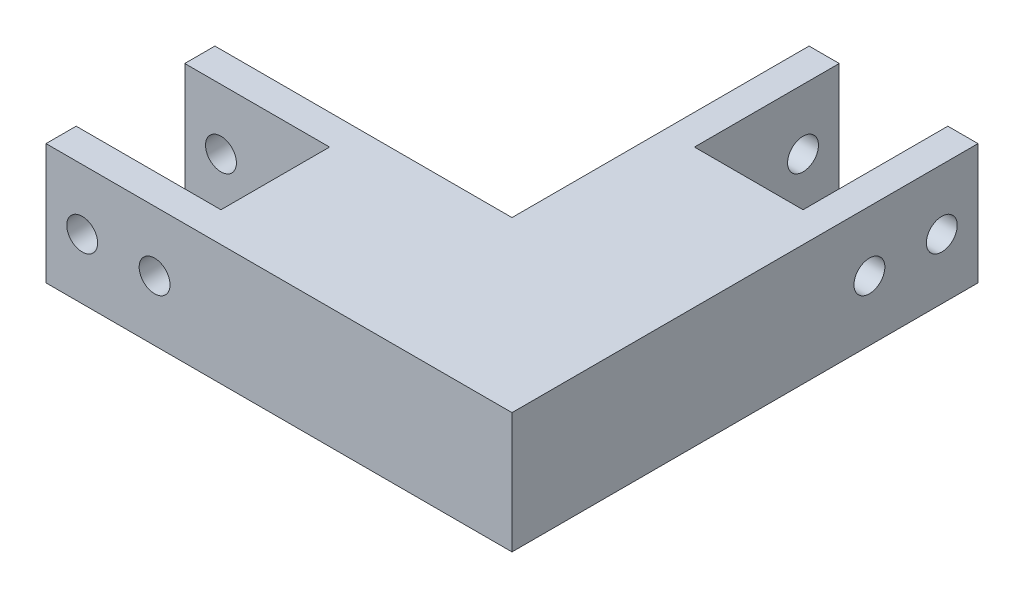
ISO-10303-21;
HEADER;
FILE_DESCRIPTION(('STEP AP214'),'2;1');
FILE_NAME('part.step','',(''),(''),'','','');
FILE_SCHEMA(('AUTOMOTIVE_DESIGN { 1 0 10303 214 1 1 1 1 }'));
ENDSEC;
DATA;
#1=APPLICATION_CONTEXT('core data for automotive mechanical design processes');
#2=APPLICATION_PROTOCOL_DEFINITION('international standard','automotive_design',2000,#1);
#3=PRODUCT_CONTEXT('',#1,'mechanical');
#4=PRODUCT('Part','Part','',(#3));
#5=PRODUCT_RELATED_PRODUCT_CATEGORY('part','',(#4));
#6=PRODUCT_DEFINITION_FORMATION('','',#4);
#7=PRODUCT_DEFINITION_CONTEXT('part definition',#1,'design');
#8=PRODUCT_DEFINITION('design','',#6,#7);
#9=PRODUCT_DEFINITION_SHAPE('','',#8);
#10=(LENGTH_UNIT() NAMED_UNIT(*) SI_UNIT(.MILLI.,.METRE.));
#11=(NAMED_UNIT(*) PLANE_ANGLE_UNIT() SI_UNIT($,.RADIAN.));
#12=(NAMED_UNIT(*) SI_UNIT($,.STERADIAN.) SOLID_ANGLE_UNIT());
#13=UNCERTAINTY_MEASURE_WITH_UNIT(LENGTH_MEASURE(1.E-05),#10,'distance_accuracy_value','');
#14=(GEOMETRIC_REPRESENTATION_CONTEXT(3) GLOBAL_UNCERTAINTY_ASSIGNED_CONTEXT((#13)) GLOBAL_UNIT_ASSIGNED_CONTEXT((#10,
#11,#12)) REPRESENTATION_CONTEXT('',''));
#15=CARTESIAN_POINT('',(0.,0.,0.));
#16=DIRECTION('',(0.,0.,1.));
#17=DIRECTION('',(1.,0.,0.));
#18=AXIS2_PLACEMENT_3D('',#15,#16,#17);
#19=CARTESIAN_POINT('',(-17.5,25.,-17.5));
#20=DIRECTION('',(1.,0.,0.));
#21=DIRECTION('',(0.,0.,-1.));
#22=AXIS2_PLACEMENT_3D('',#19,#20,#21);
#23=PLANE('',#22);
#24=CARTESIAN_POINT('',(-17.5,12.5,-56.55));
#25=DIRECTION('',(1.,0.,0.));
#26=DIRECTION('',(0.,0.,-1.));
#27=AXIS2_PLACEMENT_3D('',#24,#25,#26);
#28=CIRCLE('',#27,3.2);
#29=CARTESIAN_POINT('',(-17.5,12.5,-59.75));
#30=VERTEX_POINT('',#29);
#31=EDGE_CURVE('E296',#30,#30,#28,.F.);
#32=ORIENTED_EDGE('',*,*,#31,.F.);
#33=EDGE_LOOP('',(#32));
#34=FACE_BOUND('',#33,.T.);
#35=CARTESIAN_POINT('',(-17.5,12.5,-71.55));
#36=DIRECTION('',(1.,0.,0.));
#37=DIRECTION('',(0.,0.,-1.));
#38=AXIS2_PLACEMENT_3D('',#35,#36,#37);
#39=CIRCLE('',#38,3.2);
#40=CARTESIAN_POINT('',(-17.5,12.5,-74.75));
#41=VERTEX_POINT('',#40);
#42=EDGE_CURVE('E225',#41,#41,#39,.F.);
#43=ORIENTED_EDGE('',*,*,#42,.F.);
#44=EDGE_LOOP('',(#43));
#45=FACE_BOUND('',#44,.T.);
#46=DIRECTION('',(0.,0.,1.));
#47=VECTOR('',#46,1.);
#48=CARTESIAN_POINT('',(-17.5,0.,-17.5));
#49=LINE('',#48,#47);
#50=CARTESIAN_POINT('',(-17.5,0.,-79.05));
#51=VERTEX_POINT('',#50);
#52=CARTESIAN_POINT('',(-17.5,0.,-17.5));
#53=VERTEX_POINT('',#52);
#54=EDGE_CURVE('E167',#51,#53,#49,.T.);
#55=ORIENTED_EDGE('',*,*,#54,.T.);
#56=DIRECTION('',(0.,-1.,0.));
#57=VECTOR('',#56,1.);
#58=CARTESIAN_POINT('',(-17.5,25.,-17.5));
#59=LINE('',#58,#57);
#60=CARTESIAN_POINT('',(-17.5,25.,-17.5));
#61=VERTEX_POINT('',#60);
#62=EDGE_CURVE('E11',#61,#53,#59,.T.);
#63=ORIENTED_EDGE('',*,*,#62,.F.);
#64=DIRECTION('',(0.,0.,1.));
#65=VECTOR('',#64,1.);
#66=CARTESIAN_POINT('',(-17.5,25.,-17.5));
#67=LINE('',#66,#65);
#68=CARTESIAN_POINT('',(-17.5,25.,-79.05));
#69=VERTEX_POINT('',#68);
#70=EDGE_CURVE('E194',#69,#61,#67,.T.);
#71=ORIENTED_EDGE('',*,*,#70,.F.);
#72=DIRECTION('',(0.,-1.,0.));
#73=VECTOR('',#72,1.);
#74=CARTESIAN_POINT('',(-17.5,25.,-79.05));
#75=LINE('',#74,#73);
#76=EDGE_CURVE('E163',#69,#51,#75,.T.);
#77=ORIENTED_EDGE('',*,*,#76,.T.);
#78=EDGE_LOOP('',(#55,#63,#71,#77));
#79=FACE_BOUND('',#78,.T.);
#80=ADVANCED_FACE('F33',(#34,#45,#79),#23,.F.);
#81=CARTESIAN_POINT('',(-79.05,25.,-17.5));
#82=DIRECTION('',(0.,0.,1.));
#83=DIRECTION('',(1.,0.,0.));
#84=AXIS2_PLACEMENT_3D('',#81,#82,#83);
#85=PLANE('',#84);
#86=CARTESIAN_POINT('',(-56.55,12.5,-17.5));
#87=DIRECTION('',(0.,0.,1.));
#88=DIRECTION('',(1.,0.,0.));
#89=AXIS2_PLACEMENT_3D('',#86,#87,#88);
#90=CIRCLE('',#89,3.2);
#91=CARTESIAN_POINT('',(-53.35,12.5,-17.5));
#92=VERTEX_POINT('',#91);
#93=EDGE_CURVE('E436',#92,#92,#90,.F.);
#94=ORIENTED_EDGE('',*,*,#93,.F.);
#95=EDGE_LOOP('',(#94));
#96=FACE_BOUND('',#95,.T.);
#97=CARTESIAN_POINT('',(-71.55,12.5,-17.5));
#98=DIRECTION('',(0.,0.,1.));
#99=DIRECTION('',(1.,0.,0.));
#100=AXIS2_PLACEMENT_3D('',#97,#98,#99);
#101=CIRCLE('',#100,3.2);
#102=CARTESIAN_POINT('',(-68.35,12.5,-17.5));
#103=VERTEX_POINT('',#102);
#104=EDGE_CURVE('E444',#103,#103,#101,.F.);
#105=ORIENTED_EDGE('',*,*,#104,.F.);
#106=EDGE_LOOP('',(#105));
#107=FACE_BOUND('',#106,.T.);
#108=DIRECTION('',(-1.,0.,0.));
#109=VECTOR('',#108,1.);
#110=CARTESIAN_POINT('',(-79.05,0.,-17.5));
#111=LINE('',#110,#109);
#112=CARTESIAN_POINT('',(-79.05,0.,-17.5));
#113=VERTEX_POINT('',#112);
#114=EDGE_CURVE('E170',#53,#113,#111,.T.);
#115=ORIENTED_EDGE('',*,*,#114,.T.);
#116=DIRECTION('',(0.,-1.,0.));
#117=VECTOR('',#116,1.);
#118=CARTESIAN_POINT('',(-79.05,25.,-17.5));
#119=LINE('',#118,#117);
#120=CARTESIAN_POINT('',(-79.05,25.,-17.5));
#121=VERTEX_POINT('',#120);
#122=EDGE_CURVE('E42',#121,#113,#119,.T.);
#123=ORIENTED_EDGE('',*,*,#122,.F.);
#124=DIRECTION('',(-1.,0.,0.));
#125=VECTOR('',#124,1.);
#126=CARTESIAN_POINT('',(-79.05,25.,-17.5));
#127=LINE('',#126,#125);
#128=EDGE_CURVE('E112',#61,#121,#127,.T.);
#129=ORIENTED_EDGE('',*,*,#128,.F.);
#130=ORIENTED_EDGE('',*,*,#62,.T.);
#131=EDGE_LOOP('',(#115,#123,#129,#130));
#132=FACE_BOUND('',#131,.T.);
#133=ADVANCED_FACE('F286',(#96,#107,#132),#85,.F.);
#134=CARTESIAN_POINT('',(-79.05,25.,-11.25));
#135=DIRECTION('',(1.,0.,0.));
#136=DIRECTION('',(0.,0.,-1.));
#137=AXIS2_PLACEMENT_3D('',#134,#135,#136);
#138=PLANE('',#137);
#139=DIRECTION('',(0.,0.,1.));
#140=VECTOR('',#139,1.);
#141=CARTESIAN_POINT('',(-79.05,0.,-11.25));
#142=LINE('',#141,#140);
#143=CARTESIAN_POINT('',(-79.05,0.,-11.25));
#144=VERTEX_POINT('',#143);
#145=EDGE_CURVE('E173',#113,#144,#142,.T.);
#146=ORIENTED_EDGE('',*,*,#145,.T.);
#147=DIRECTION('',(0.,-1.,0.));
#148=VECTOR('',#147,1.);
#149=CARTESIAN_POINT('',(-79.05,25.,-11.25));
#150=LINE('',#149,#148);
#151=CARTESIAN_POINT('',(-79.05,25.,-11.25));
#152=VERTEX_POINT('',#151);
#153=EDGE_CURVE('E219',#152,#144,#150,.T.);
#154=ORIENTED_EDGE('',*,*,#153,.F.);
#155=DIRECTION('',(0.,0.,1.));
#156=VECTOR('',#155,1.);
#157=CARTESIAN_POINT('',(-79.05,25.,-11.25));
#158=LINE('',#157,#156);
#159=EDGE_CURVE('E242',#121,#152,#158,.T.);
#160=ORIENTED_EDGE('',*,*,#159,.F.);
#161=ORIENTED_EDGE('',*,*,#122,.T.);
#162=EDGE_LOOP('',(#146,#154,#160,#161));
#163=FACE_BOUND('',#162,.T.);
#164=ADVANCED_FACE('F291',(#163),#138,.F.);
#165=CARTESIAN_POINT('',(-49.05,25.,-11.25));
#166=DIRECTION('',(0.,0.,-1.));
#167=DIRECTION('',(-1.,0.,0.));
#168=AXIS2_PLACEMENT_3D('',#165,#166,#167);
#169=PLANE('',#168);
#170=CARTESIAN_POINT('',(-56.55,12.5,-11.25));
#171=DIRECTION('',(0.,0.,-1.));
#172=DIRECTION('',(-1.,0.,0.));
#173=AXIS2_PLACEMENT_3D('',#170,#171,#172);
#174=CIRCLE('',#173,3.2);
#175=CARTESIAN_POINT('',(-59.75,12.5,-11.25));
#176=VERTEX_POINT('',#175);
#177=EDGE_CURVE('E439',#176,#176,#174,.T.);
#178=ORIENTED_EDGE('',*,*,#177,.T.);
#179=EDGE_LOOP('',(#178));
#180=FACE_BOUND('',#179,.T.);
#181=CARTESIAN_POINT('',(-71.55,12.5,-11.25));
#182=DIRECTION('',(0.,0.,-1.));
#183=DIRECTION('',(-1.,0.,0.));
#184=AXIS2_PLACEMENT_3D('',#181,#182,#183);
#185=CIRCLE('',#184,3.2);
#186=CARTESIAN_POINT('',(-74.75,12.5,-11.25));
#187=VERTEX_POINT('',#186);
#188=EDGE_CURVE('E302',#187,#187,#185,.T.);
#189=ORIENTED_EDGE('',*,*,#188,.T.);
#190=EDGE_LOOP('',(#189));
#191=FACE_BOUND('',#190,.T.);
#192=DIRECTION('',(1.,0.,0.));
#193=VECTOR('',#192,1.);
#194=CARTESIAN_POINT('',(-49.05,0.,-11.25));
#195=LINE('',#194,#193);
#196=CARTESIAN_POINT('',(-49.05,0.,-11.25));
#197=VERTEX_POINT('',#196);
#198=EDGE_CURVE('E175',#144,#197,#195,.T.);
#199=ORIENTED_EDGE('',*,*,#198,.T.);
#200=DIRECTION('',(0.,-1.,0.));
#201=VECTOR('',#200,1.);
#202=CARTESIAN_POINT('',(-49.05,25.,-11.25));
#203=LINE('',#202,#201);
#204=CARTESIAN_POINT('',(-49.05,25.,-11.25));
#205=VERTEX_POINT('',#204);
#206=EDGE_CURVE('E216',#205,#197,#203,.T.);
#207=ORIENTED_EDGE('',*,*,#206,.F.);
#208=DIRECTION('',(1.,0.,0.));
#209=VECTOR('',#208,1.);
#210=CARTESIAN_POINT('',(-49.05,25.,-11.25));
#211=LINE('',#210,#209);
#212=EDGE_CURVE('E244',#152,#205,#211,.T.);
#213=ORIENTED_EDGE('',*,*,#212,.F.);
#214=ORIENTED_EDGE('',*,*,#153,.T.);
#215=EDGE_LOOP('',(#199,#207,#213,#214));
#216=FACE_BOUND('',#215,.T.);
#217=ADVANCED_FACE('F364',(#180,#191,#216),#169,.F.);
#218=CARTESIAN_POINT('',(-49.05,25.,11.25));
#219=DIRECTION('',(1.,0.,0.));
#220=DIRECTION('',(0.,0.,-1.));
#221=AXIS2_PLACEMENT_3D('',#218,#219,#220);
#222=PLANE('',#221);
#223=DIRECTION('',(0.,0.,1.));
#224=VECTOR('',#223,1.);
#225=CARTESIAN_POINT('',(-49.05,0.,11.25));
#226=LINE('',#225,#224);
#227=CARTESIAN_POINT('',(-49.05,0.,11.25));
#228=VERTEX_POINT('',#227);
#229=EDGE_CURVE('E177',#197,#228,#226,.T.);
#230=ORIENTED_EDGE('',*,*,#229,.T.);
#231=DIRECTION('',(0.,-1.,0.));
#232=VECTOR('',#231,1.);
#233=CARTESIAN_POINT('',(-49.05,25.,11.25));
#234=LINE('',#233,#232);
#235=CARTESIAN_POINT('',(-49.05,25.,11.25));
#236=VERTEX_POINT('',#235);
#237=EDGE_CURVE('E213',#236,#228,#234,.T.);
#238=ORIENTED_EDGE('',*,*,#237,.F.);
#239=DIRECTION('',(0.,0.,1.));
#240=VECTOR('',#239,1.);
#241=CARTESIAN_POINT('',(-49.05,25.,11.25));
#242=LINE('',#241,#240);
#243=EDGE_CURVE('E246',#205,#236,#242,.T.);
#244=ORIENTED_EDGE('',*,*,#243,.F.);
#245=ORIENTED_EDGE('',*,*,#206,.T.);
#246=EDGE_LOOP('',(#230,#238,#244,#245));
#247=FACE_BOUND('',#246,.T.);
#248=ADVANCED_FACE('F369',(#247),#222,.F.);
#249=CARTESIAN_POINT('',(-79.05,25.,11.25));
#250=DIRECTION('',(0.,0.,1.));
#251=DIRECTION('',(1.,0.,0.));
#252=AXIS2_PLACEMENT_3D('',#249,#250,#251);
#253=PLANE('',#252);
#254=CARTESIAN_POINT('',(-56.55,12.5,11.25));
#255=DIRECTION('',(0.,0.,1.));
#256=DIRECTION('',(1.,0.,0.));
#257=AXIS2_PLACEMENT_3D('',#254,#255,#256);
#258=CIRCLE('',#257,3.2);
#259=CARTESIAN_POINT('',(-53.35,12.5,11.25));
#260=VERTEX_POINT('',#259);
#261=EDGE_CURVE('E441',#260,#260,#258,.T.);
#262=ORIENTED_EDGE('',*,*,#261,.T.);
#263=EDGE_LOOP('',(#262));
#264=FACE_BOUND('',#263,.T.);
#265=CARTESIAN_POINT('',(-71.55,12.5,11.25));
#266=DIRECTION('',(0.,0.,1.));
#267=DIRECTION('',(1.,0.,0.));
#268=AXIS2_PLACEMENT_3D('',#265,#266,#267);
#269=CIRCLE('',#268,3.2);
#270=CARTESIAN_POINT('',(-68.35,12.5,11.25));
#271=VERTEX_POINT('',#270);
#272=EDGE_CURVE('E452',#271,#271,#269,.T.);
#273=ORIENTED_EDGE('',*,*,#272,.T.);
#274=EDGE_LOOP('',(#273));
#275=FACE_BOUND('',#274,.T.);
#276=DIRECTION('',(-1.,0.,0.));
#277=VECTOR('',#276,1.);
#278=CARTESIAN_POINT('',(-79.05,0.,11.25));
#279=LINE('',#278,#277);
#280=CARTESIAN_POINT('',(-79.05,0.,11.25));
#281=VERTEX_POINT('',#280);
#282=EDGE_CURVE('E179',#228,#281,#279,.T.);
#283=ORIENTED_EDGE('',*,*,#282,.T.);
#284=DIRECTION('',(0.,-1.,0.));
#285=VECTOR('',#284,1.);
#286=CARTESIAN_POINT('',(-79.05,25.,11.25));
#287=LINE('',#286,#285);
#288=CARTESIAN_POINT('',(-79.05,25.,11.25));
#289=VERTEX_POINT('',#288);
#290=EDGE_CURVE('E210',#289,#281,#287,.T.);
#291=ORIENTED_EDGE('',*,*,#290,.F.);
#292=DIRECTION('',(-1.,0.,0.));
#293=VECTOR('',#292,1.);
#294=CARTESIAN_POINT('',(-79.05,25.,11.25));
#295=LINE('',#294,#293);
#296=EDGE_CURVE('E248',#236,#289,#295,.T.);
#297=ORIENTED_EDGE('',*,*,#296,.F.);
#298=ORIENTED_EDGE('',*,*,#237,.T.);
#299=EDGE_LOOP('',(#283,#291,#297,#298));
#300=FACE_BOUND('',#299,.T.);
#301=ADVANCED_FACE('F377',(#264,#275,#300),#253,.F.);
#302=CARTESIAN_POINT('',(-79.05,25.,17.5));
#303=DIRECTION('',(1.,0.,0.));
#304=DIRECTION('',(0.,0.,-1.));
#305=AXIS2_PLACEMENT_3D('',#302,#303,#304);
#306=PLANE('',#305);
#307=DIRECTION('',(0.,0.,1.));
#308=VECTOR('',#307,1.);
#309=CARTESIAN_POINT('',(-79.05,0.,17.5));
#310=LINE('',#309,#308);
#311=CARTESIAN_POINT('',(-79.05,0.,17.5));
#312=VERTEX_POINT('',#311);
#313=EDGE_CURVE('E181',#281,#312,#310,.T.);
#314=ORIENTED_EDGE('',*,*,#313,.T.);
#315=DIRECTION('',(0.,-1.,0.));
#316=VECTOR('',#315,1.);
#317=CARTESIAN_POINT('',(-79.05,25.,17.5));
#318=LINE('',#317,#316);
#319=CARTESIAN_POINT('',(-79.05,25.,17.5));
#320=VERTEX_POINT('',#319);
#321=EDGE_CURVE('E207',#320,#312,#318,.T.);
#322=ORIENTED_EDGE('',*,*,#321,.F.);
#323=DIRECTION('',(0.,0.,1.));
#324=VECTOR('',#323,1.);
#325=CARTESIAN_POINT('',(-79.05,25.,17.5));
#326=LINE('',#325,#324);
#327=EDGE_CURVE('E250',#289,#320,#326,.T.);
#328=ORIENTED_EDGE('',*,*,#327,.F.);
#329=ORIENTED_EDGE('',*,*,#290,.T.);
#330=EDGE_LOOP('',(#314,#322,#328,#329));
#331=FACE_BOUND('',#330,.T.);
#332=ADVANCED_FACE('F382',(#331),#306,.F.);
#333=CARTESIAN_POINT('',(17.5,25.,17.5));
#334=DIRECTION('',(0.,0.,-1.));
#335=DIRECTION('',(-1.,0.,0.));
#336=AXIS2_PLACEMENT_3D('',#333,#334,#335);
#337=PLANE('',#336);
#338=CARTESIAN_POINT('',(-56.55,12.5,17.5));
#339=DIRECTION('',(0.,0.,1.));
#340=DIRECTION('',(1.,0.,0.));
#341=AXIS2_PLACEMENT_3D('',#338,#339,#340);
#342=CIRCLE('',#341,3.2);
#343=CARTESIAN_POINT('',(-53.35,12.5,17.5));
#344=VERTEX_POINT('',#343);
#345=EDGE_CURVE('E569',#344,#344,#342,.T.);
#346=ORIENTED_EDGE('',*,*,#345,.F.);
#347=EDGE_LOOP('',(#346));
#348=FACE_BOUND('',#347,.T.);
#349=CARTESIAN_POINT('',(-71.55,12.5,17.5));
#350=DIRECTION('',(0.,0.,1.));
#351=DIRECTION('',(1.,0.,0.));
#352=AXIS2_PLACEMENT_3D('',#349,#350,#351);
#353=CIRCLE('',#352,3.2);
#354=CARTESIAN_POINT('',(-68.35,12.5,17.5));
#355=VERTEX_POINT('',#354);
#356=EDGE_CURVE('E440',#355,#355,#353,.T.);
#357=ORIENTED_EDGE('',*,*,#356,.F.);
#358=EDGE_LOOP('',(#357));
#359=FACE_BOUND('',#358,.T.);
#360=DIRECTION('',(1.,0.,0.));
#361=VECTOR('',#360,1.);
#362=CARTESIAN_POINT('',(17.5,0.,17.5));
#363=LINE('',#362,#361);
#364=CARTESIAN_POINT('',(17.5,0.,17.5));
#365=VERTEX_POINT('',#364);
#366=EDGE_CURVE('E183',#312,#365,#363,.T.);
#367=ORIENTED_EDGE('',*,*,#366,.T.);
#368=DIRECTION('',(0.,-1.,0.));
#369=VECTOR('',#368,1.);
#370=CARTESIAN_POINT('',(17.5,25.,17.5));
#371=LINE('',#370,#369);
#372=CARTESIAN_POINT('',(17.5,25.,17.5));
#373=VERTEX_POINT('',#372);
#374=EDGE_CURVE('E204',#373,#365,#371,.T.);
#375=ORIENTED_EDGE('',*,*,#374,.F.);
#376=DIRECTION('',(1.,0.,0.));
#377=VECTOR('',#376,1.);
#378=CARTESIAN_POINT('',(17.5,25.,17.5));
#379=LINE('',#378,#377);
#380=EDGE_CURVE('E252',#320,#373,#379,.T.);
#381=ORIENTED_EDGE('',*,*,#380,.F.);
#382=ORIENTED_EDGE('',*,*,#321,.T.);
#383=EDGE_LOOP('',(#367,#375,#381,#382));
#384=FACE_BOUND('',#383,.T.);
#385=ADVANCED_FACE('F390',(#348,#359,#384),#337,.F.);
#386=CARTESIAN_POINT('',(17.5,25.,-79.05));
#387=DIRECTION('',(-1.,0.,0.));
#388=DIRECTION('',(0.,0.,1.));
#389=AXIS2_PLACEMENT_3D('',#386,#387,#388);
#390=PLANE('',#389);
#391=CARTESIAN_POINT('',(17.5,12.5,-56.55));
#392=DIRECTION('',(1.,0.,0.));
#393=DIRECTION('',(0.,0.,-1.));
#394=AXIS2_PLACEMENT_3D('',#391,#392,#393);
#395=CIRCLE('',#394,3.2);
#396=CARTESIAN_POINT('',(17.5,12.5,-59.75));
#397=VERTEX_POINT('',#396);
#398=EDGE_CURVE('E298',#397,#397,#395,.T.);
#399=ORIENTED_EDGE('',*,*,#398,.F.);
#400=EDGE_LOOP('',(#399));
#401=FACE_BOUND('',#400,.T.);
#402=CARTESIAN_POINT('',(17.5,12.5,-71.55));
#403=DIRECTION('',(1.,0.,0.));
#404=DIRECTION('',(0.,0.,-1.));
#405=AXIS2_PLACEMENT_3D('',#402,#403,#404);
#406=CIRCLE('',#405,3.2);
#407=CARTESIAN_POINT('',(17.5,12.5,-74.75));
#408=VERTEX_POINT('',#407);
#409=EDGE_CURVE('E231',#408,#408,#406,.T.);
#410=ORIENTED_EDGE('',*,*,#409,.F.);
#411=EDGE_LOOP('',(#410));
#412=FACE_BOUND('',#411,.T.);
#413=DIRECTION('',(0.,0.,-1.));
#414=VECTOR('',#413,1.);
#415=CARTESIAN_POINT('',(17.5,0.,-79.05));
#416=LINE('',#415,#414);
#417=CARTESIAN_POINT('',(17.5,0.,-79.05));
#418=VERTEX_POINT('',#417);
#419=EDGE_CURVE('E185',#365,#418,#416,.T.);
#420=ORIENTED_EDGE('',*,*,#419,.T.);
#421=DIRECTION('',(0.,-1.,0.));
#422=VECTOR('',#421,1.);
#423=CARTESIAN_POINT('',(17.5,25.,-79.05));
#424=LINE('',#423,#422);
#425=CARTESIAN_POINT('',(17.5,25.,-79.05));
#426=VERTEX_POINT('',#425);
#427=EDGE_CURVE('E201',#426,#418,#424,.T.);
#428=ORIENTED_EDGE('',*,*,#427,.F.);
#429=DIRECTION('',(0.,0.,-1.));
#430=VECTOR('',#429,1.);
#431=CARTESIAN_POINT('',(17.5,25.,-79.05));
#432=LINE('',#431,#430);
#433=EDGE_CURVE('E254',#373,#426,#432,.T.);
#434=ORIENTED_EDGE('',*,*,#433,.F.);
#435=ORIENTED_EDGE('',*,*,#374,.T.);
#436=EDGE_LOOP('',(#420,#428,#434,#435));
#437=FACE_BOUND('',#436,.T.);
#438=ADVANCED_FACE('F395',(#401,#412,#437),#390,.F.);
#439=CARTESIAN_POINT('',(11.25,25.,-79.05));
#440=DIRECTION('',(0.,0.,1.));
#441=DIRECTION('',(1.,0.,0.));
#442=AXIS2_PLACEMENT_3D('',#439,#440,#441);
#443=PLANE('',#442);
#444=DIRECTION('',(-1.,0.,0.));
#445=VECTOR('',#444,1.);
#446=CARTESIAN_POINT('',(11.25,0.,-79.05));
#447=LINE('',#446,#445);
#448=CARTESIAN_POINT('',(11.25,0.,-79.05));
#449=VERTEX_POINT('',#448);
#450=EDGE_CURVE('E187',#418,#449,#447,.T.);
#451=ORIENTED_EDGE('',*,*,#450,.T.);
#452=DIRECTION('',(0.,-1.,0.));
#453=VECTOR('',#452,1.);
#454=CARTESIAN_POINT('',(11.25,25.,-79.05));
#455=LINE('',#454,#453);
#456=CARTESIAN_POINT('',(11.25,25.,-79.05));
#457=VERTEX_POINT('',#456);
#458=EDGE_CURVE('E198',#457,#449,#455,.T.);
#459=ORIENTED_EDGE('',*,*,#458,.F.);
#460=DIRECTION('',(-1.,0.,0.));
#461=VECTOR('',#460,1.);
#462=CARTESIAN_POINT('',(11.25,25.,-79.05));
#463=LINE('',#462,#461);
#464=EDGE_CURVE('E256',#426,#457,#463,.T.);
#465=ORIENTED_EDGE('',*,*,#464,.F.);
#466=ORIENTED_EDGE('',*,*,#427,.T.);
#467=EDGE_LOOP('',(#451,#459,#465,#466));
#468=FACE_BOUND('',#467,.T.);
#469=ADVANCED_FACE('F262',(#468),#443,.F.);
#470=CARTESIAN_POINT('',(11.25,25.,-49.05));
#471=DIRECTION('',(1.,0.,0.));
#472=DIRECTION('',(0.,0.,-1.));
#473=AXIS2_PLACEMENT_3D('',#470,#471,#472);
#474=PLANE('',#473);
#475=CARTESIAN_POINT('',(11.25,12.5,-56.55));
#476=DIRECTION('',(1.,0.,0.));
#477=DIRECTION('',(0.,0.,-1.));
#478=AXIS2_PLACEMENT_3D('',#475,#476,#477);
#479=CIRCLE('',#478,3.2);
#480=CARTESIAN_POINT('',(11.25,12.5,-59.75));
#481=VERTEX_POINT('',#480);
#482=EDGE_CURVE('E236',#481,#481,#479,.T.);
#483=ORIENTED_EDGE('',*,*,#482,.T.);
#484=EDGE_LOOP('',(#483));
#485=FACE_BOUND('',#484,.T.);
#486=CARTESIAN_POINT('',(11.25,12.5,-71.55));
#487=DIRECTION('',(1.,0.,0.));
#488=DIRECTION('',(0.,0.,-1.));
#489=AXIS2_PLACEMENT_3D('',#486,#487,#488);
#490=CIRCLE('',#489,3.2);
#491=CARTESIAN_POINT('',(11.25,12.5,-74.75));
#492=VERTEX_POINT('',#491);
#493=EDGE_CURVE('E171',#492,#492,#490,.T.);
#494=ORIENTED_EDGE('',*,*,#493,.T.);
#495=EDGE_LOOP('',(#494));
#496=FACE_BOUND('',#495,.T.);
#497=DIRECTION('',(0.,0.,1.));
#498=VECTOR('',#497,1.);
#499=CARTESIAN_POINT('',(11.25,0.,-49.05));
#500=LINE('',#499,#498);
#501=CARTESIAN_POINT('',(11.25,0.,-49.05));
#502=VERTEX_POINT('',#501);
#503=EDGE_CURVE('E189',#449,#502,#500,.T.);
#504=ORIENTED_EDGE('',*,*,#503,.T.);
#505=DIRECTION('',(0.,-1.,0.));
#506=VECTOR('',#505,1.);
#507=CARTESIAN_POINT('',(11.25,25.,-49.05));
#508=LINE('',#507,#506);
#509=CARTESIAN_POINT('',(11.25,25.,-49.05));
#510=VERTEX_POINT('',#509);
#511=EDGE_CURVE('E158',#510,#502,#508,.T.);
#512=ORIENTED_EDGE('',*,*,#511,.F.);
#513=DIRECTION('',(0.,0.,1.));
#514=VECTOR('',#513,1.);
#515=CARTESIAN_POINT('',(11.25,25.,-49.05));
#516=LINE('',#515,#514);
#517=EDGE_CURVE('E149',#457,#510,#516,.T.);
#518=ORIENTED_EDGE('',*,*,#517,.F.);
#519=ORIENTED_EDGE('',*,*,#458,.T.);
#520=EDGE_LOOP('',(#504,#512,#518,#519));
#521=FACE_BOUND('',#520,.T.);
#522=ADVANCED_FACE('F266',(#485,#496,#521),#474,.F.);
#523=CARTESIAN_POINT('',(-11.25,25.,-49.05));
#524=DIRECTION('',(0.,0.,1.));
#525=DIRECTION('',(1.,0.,0.));
#526=AXIS2_PLACEMENT_3D('',#523,#524,#525);
#527=PLANE('',#526);
#528=DIRECTION('',(-1.,0.,0.));
#529=VECTOR('',#528,1.);
#530=CARTESIAN_POINT('',(-11.25,0.,-49.05));
#531=LINE('',#530,#529);
#532=CARTESIAN_POINT('',(-11.25,0.,-49.05));
#533=VERTEX_POINT('',#532);
#534=EDGE_CURVE('E157',#502,#533,#531,.T.);
#535=ORIENTED_EDGE('',*,*,#534,.T.);
#536=DIRECTION('',(0.,-1.,0.));
#537=VECTOR('',#536,1.);
#538=CARTESIAN_POINT('',(-11.25,25.,-49.05));
#539=LINE('',#538,#537);
#540=CARTESIAN_POINT('',(-11.25,25.,-49.05));
#541=VERTEX_POINT('',#540);
#542=EDGE_CURVE('E154',#541,#533,#539,.T.);
#543=ORIENTED_EDGE('',*,*,#542,.F.);
#544=DIRECTION('',(-1.,0.,0.));
#545=VECTOR('',#544,1.);
#546=CARTESIAN_POINT('',(-11.25,25.,-49.05));
#547=LINE('',#546,#545);
#548=EDGE_CURVE('E143',#510,#541,#547,.T.);
#549=ORIENTED_EDGE('',*,*,#548,.F.);
#550=ORIENTED_EDGE('',*,*,#511,.T.);
#551=EDGE_LOOP('',(#535,#543,#549,#550));
#552=FACE_BOUND('',#551,.T.);
#553=ADVANCED_FACE('F155',(#552),#527,.F.);
#554=CARTESIAN_POINT('',(-11.25,25.,-79.05));
#555=DIRECTION('',(-1.,0.,0.));
#556=DIRECTION('',(0.,0.,1.));
#557=AXIS2_PLACEMENT_3D('',#554,#555,#556);
#558=PLANE('',#557);
#559=CARTESIAN_POINT('',(-11.25,12.5,-56.55));
#560=DIRECTION('',(-1.,0.,0.));
#561=DIRECTION('',(0.,0.,1.));
#562=AXIS2_PLACEMENT_3D('',#559,#560,#561);
#563=CIRCLE('',#562,3.2);
#564=CARTESIAN_POINT('',(-11.25,12.5,-53.35));
#565=VERTEX_POINT('',#564);
#566=EDGE_CURVE('E36',#565,#565,#563,.T.);
#567=ORIENTED_EDGE('',*,*,#566,.T.);
#568=EDGE_LOOP('',(#567));
#569=FACE_BOUND('',#568,.T.);
#570=CARTESIAN_POINT('',(-11.25,12.5,-71.55));
#571=DIRECTION('',(-1.,0.,0.));
#572=DIRECTION('',(0.,0.,1.));
#573=AXIS2_PLACEMENT_3D('',#570,#571,#572);
#574=CIRCLE('',#573,3.2);
#575=CARTESIAN_POINT('',(-11.25,12.5,-68.35));
#576=VERTEX_POINT('',#575);
#577=EDGE_CURVE('E223',#576,#576,#574,.T.);
#578=ORIENTED_EDGE('',*,*,#577,.T.);
#579=EDGE_LOOP('',(#578));
#580=FACE_BOUND('',#579,.T.);
#581=DIRECTION('',(0.,0.,-1.));
#582=VECTOR('',#581,1.);
#583=CARTESIAN_POINT('',(-11.25,0.,-79.05));
#584=LINE('',#583,#582);
#585=CARTESIAN_POINT('',(-11.25,0.,-79.05));
#586=VERTEX_POINT('',#585);
#587=EDGE_CURVE('E98',#533,#586,#584,.T.);
#588=ORIENTED_EDGE('',*,*,#587,.T.);
#589=DIRECTION('',(0.,-1.,0.));
#590=VECTOR('',#589,1.);
#591=CARTESIAN_POINT('',(-11.25,25.,-79.05));
#592=LINE('',#591,#590);
#593=CARTESIAN_POINT('',(-11.25,25.,-79.05));
#594=VERTEX_POINT('',#593);
#595=EDGE_CURVE('E159',#594,#586,#592,.T.);
#596=ORIENTED_EDGE('',*,*,#595,.F.);
#597=DIRECTION('',(0.,0.,-1.));
#598=VECTOR('',#597,1.);
#599=CARTESIAN_POINT('',(-11.25,25.,-79.05));
#600=LINE('',#599,#598);
#601=EDGE_CURVE('E147',#541,#594,#600,.T.);
#602=ORIENTED_EDGE('',*,*,#601,.F.);
#603=ORIENTED_EDGE('',*,*,#542,.T.);
#604=EDGE_LOOP('',(#588,#596,#602,#603));
#605=FACE_BOUND('',#604,.T.);
#606=ADVANCED_FACE('F161',(#569,#580,#605),#558,.F.);
#607=CARTESIAN_POINT('',(-17.5,25.,-79.05));
#608=DIRECTION('',(0.,0.,1.));
#609=DIRECTION('',(1.,0.,0.));
#610=AXIS2_PLACEMENT_3D('',#607,#608,#609);
#611=PLANE('',#610);
#612=DIRECTION('',(-1.,0.,0.));
#613=VECTOR('',#612,1.);
#614=CARTESIAN_POINT('',(-17.5,0.,-79.05));
#615=LINE('',#614,#613);
#616=EDGE_CURVE('E104',#586,#51,#615,.T.);
#617=ORIENTED_EDGE('',*,*,#616,.T.);
#618=ORIENTED_EDGE('',*,*,#76,.F.);
#619=DIRECTION('',(-1.,0.,0.));
#620=VECTOR('',#619,1.);
#621=CARTESIAN_POINT('',(-17.5,25.,-79.05));
#622=LINE('',#621,#620);
#623=EDGE_CURVE('E51',#594,#69,#622,.T.);
#624=ORIENTED_EDGE('',*,*,#623,.F.);
#625=ORIENTED_EDGE('',*,*,#595,.T.);
#626=EDGE_LOOP('',(#617,#618,#624,#625));
#627=FACE_BOUND('',#626,.T.);
#628=ADVANCED_FACE('F274',(#627),#611,.F.);
#629=CARTESIAN_POINT('',(0.,25.,0.));
#630=DIRECTION('',(0.,-1.,0.));
#631=DIRECTION('',(0.,0.,-1.));
#632=AXIS2_PLACEMENT_3D('',#629,#630,#631);
#633=PLANE('',#632);
#634=ORIENTED_EDGE('',*,*,#70,.T.);
#635=ORIENTED_EDGE('',*,*,#128,.T.);
#636=ORIENTED_EDGE('',*,*,#159,.T.);
#637=ORIENTED_EDGE('',*,*,#212,.T.);
#638=ORIENTED_EDGE('',*,*,#243,.T.);
#639=ORIENTED_EDGE('',*,*,#296,.T.);
#640=ORIENTED_EDGE('',*,*,#327,.T.);
#641=ORIENTED_EDGE('',*,*,#380,.T.);
#642=ORIENTED_EDGE('',*,*,#433,.T.);
#643=ORIENTED_EDGE('',*,*,#464,.T.);
#644=ORIENTED_EDGE('',*,*,#517,.T.);
#645=ORIENTED_EDGE('',*,*,#548,.T.);
#646=ORIENTED_EDGE('',*,*,#601,.T.);
#647=ORIENTED_EDGE('',*,*,#623,.T.);
#648=EDGE_LOOP('',(#634,#635,#636,#637,#638,#639,#640,#641,#642,#643,#644,#645,#646,#647));
#649=FACE_BOUND('',#648,.T.);
#650=ADVANCED_FACE('F145',(#649),#633,.F.);
#651=CARTESIAN_POINT('',(0.,0.,0.));
#652=DIRECTION('',(0.,-1.,0.));
#653=DIRECTION('',(0.,0.,-1.));
#654=AXIS2_PLACEMENT_3D('',#651,#652,#653);
#655=PLANE('',#654);
#656=ORIENTED_EDGE('',*,*,#54,.F.);
#657=ORIENTED_EDGE('',*,*,#616,.F.);
#658=ORIENTED_EDGE('',*,*,#587,.F.);
#659=ORIENTED_EDGE('',*,*,#534,.F.);
#660=ORIENTED_EDGE('',*,*,#503,.F.);
#661=ORIENTED_EDGE('',*,*,#450,.F.);
#662=ORIENTED_EDGE('',*,*,#419,.F.);
#663=ORIENTED_EDGE('',*,*,#366,.F.);
#664=ORIENTED_EDGE('',*,*,#313,.F.);
#665=ORIENTED_EDGE('',*,*,#282,.F.);
#666=ORIENTED_EDGE('',*,*,#229,.F.);
#667=ORIENTED_EDGE('',*,*,#198,.F.);
#668=ORIENTED_EDGE('',*,*,#145,.F.);
#669=ORIENTED_EDGE('',*,*,#114,.F.);
#670=EDGE_LOOP('',(#656,#657,#658,#659,#660,#661,#662,#663,#664,#665,#666,#667,#668,#669));
#671=FACE_BOUND('',#670,.T.);
#672=ADVANCED_FACE('F269',(#671),#655,.T.);
#673=CARTESIAN_POINT('',(-26.5509667991878,12.5,-71.55));
#674=DIRECTION('',(1.,0.,0.));
#675=DIRECTION('',(0.,0.,-1.));
#676=AXIS2_PLACEMENT_3D('',#673,#674,#675);
#677=CYLINDRICAL_SURFACE('',#676,3.2);
#678=ORIENTED_EDGE('',*,*,#42,.T.);
#679=EDGE_LOOP('',(#678));
#680=FACE_BOUND('',#679,.T.);
#681=ORIENTED_EDGE('',*,*,#577,.F.);
#682=EDGE_LOOP('',(#681));
#683=FACE_BOUND('',#682,.T.);
#684=ADVANCED_FACE('F327',(#680,#683),#677,.F.);
#685=ORIENTED_EDGE('',*,*,#409,.T.);
#686=EDGE_LOOP('',(#685));
#687=FACE_BOUND('',#686,.T.);
#688=ORIENTED_EDGE('',*,*,#493,.F.);
#689=EDGE_LOOP('',(#688));
#690=FACE_BOUND('',#689,.T.);
#691=ADVANCED_FACE('F323',(#687,#690),#677,.F.);
#692=CARTESIAN_POINT('',(-26.5509667991878,12.5,-56.55));
#693=DIRECTION('',(1.,0.,0.));
#694=DIRECTION('',(0.,0.,-1.));
#695=AXIS2_PLACEMENT_3D('',#692,#693,#694);
#696=CYLINDRICAL_SURFACE('',#695,3.2);
#697=ORIENTED_EDGE('',*,*,#31,.T.);
#698=EDGE_LOOP('',(#697));
#699=FACE_BOUND('',#698,.T.);
#700=ORIENTED_EDGE('',*,*,#566,.F.);
#701=EDGE_LOOP('',(#700));
#702=FACE_BOUND('',#701,.T.);
#703=ADVANCED_FACE('F313',(#699,#702),#696,.F.);
#704=ORIENTED_EDGE('',*,*,#398,.T.);
#705=EDGE_LOOP('',(#704));
#706=FACE_BOUND('',#705,.T.);
#707=ORIENTED_EDGE('',*,*,#482,.F.);
#708=EDGE_LOOP('',(#707));
#709=FACE_BOUND('',#708,.T.);
#710=ADVANCED_FACE('F310',(#706,#709),#696,.F.);
#711=CARTESIAN_POINT('',(-71.55,12.5,-26.5509667991878));
#712=DIRECTION('',(0.,0.,1.));
#713=DIRECTION('',(1.,0.,0.));
#714=AXIS2_PLACEMENT_3D('',#711,#712,#713);
#715=CYLINDRICAL_SURFACE('',#714,3.2);
#716=ORIENTED_EDGE('',*,*,#356,.T.);
#717=EDGE_LOOP('',(#716));
#718=FACE_BOUND('',#717,.T.);
#719=ORIENTED_EDGE('',*,*,#272,.F.);
#720=EDGE_LOOP('',(#719));
#721=FACE_BOUND('',#720,.T.);
#722=ADVANCED_FACE('F312',(#718,#721),#715,.F.);
#723=ORIENTED_EDGE('',*,*,#104,.T.);
#724=EDGE_LOOP('',(#723));
#725=FACE_BOUND('',#724,.T.);
#726=ORIENTED_EDGE('',*,*,#188,.F.);
#727=EDGE_LOOP('',(#726));
#728=FACE_BOUND('',#727,.T.);
#729=ADVANCED_FACE('F320',(#725,#728),#715,.F.);
#730=CARTESIAN_POINT('',(-56.55,12.5,-26.5509667991878));
#731=DIRECTION('',(0.,0.,1.));
#732=DIRECTION('',(1.,0.,0.));
#733=AXIS2_PLACEMENT_3D('',#730,#731,#732);
#734=CYLINDRICAL_SURFACE('',#733,3.2);
#735=ORIENTED_EDGE('',*,*,#345,.T.);
#736=EDGE_LOOP('',(#735));
#737=FACE_BOUND('',#736,.T.);
#738=ORIENTED_EDGE('',*,*,#261,.F.);
#739=EDGE_LOOP('',(#738));
#740=FACE_BOUND('',#739,.T.);
#741=ADVANCED_FACE('F412',(#737,#740),#734,.F.);
#742=ORIENTED_EDGE('',*,*,#93,.T.);
#743=EDGE_LOOP('',(#742));
#744=FACE_BOUND('',#743,.T.);
#745=ORIENTED_EDGE('',*,*,#177,.F.);
#746=EDGE_LOOP('',(#745));
#747=FACE_BOUND('',#746,.T.);
#748=ADVANCED_FACE('F421',(#744,#747),#734,.F.);
#749=CLOSED_SHELL('',(#80,#133,#164,#217,#248,#301,#332,#385,#438,#469,#522,#553,#606,#628,#650,
#672,#684,#691,#703,#710,#722,#729,#741,#748));
#750=MANIFOLD_SOLID_BREP('B2',#749);
#751=ADVANCED_BREP_SHAPE_REPRESENTATION('',(#18,#750),#14);
#752=SHAPE_DEFINITION_REPRESENTATION(#9,#751);
ENDSEC;
END-ISO-10303-21;
